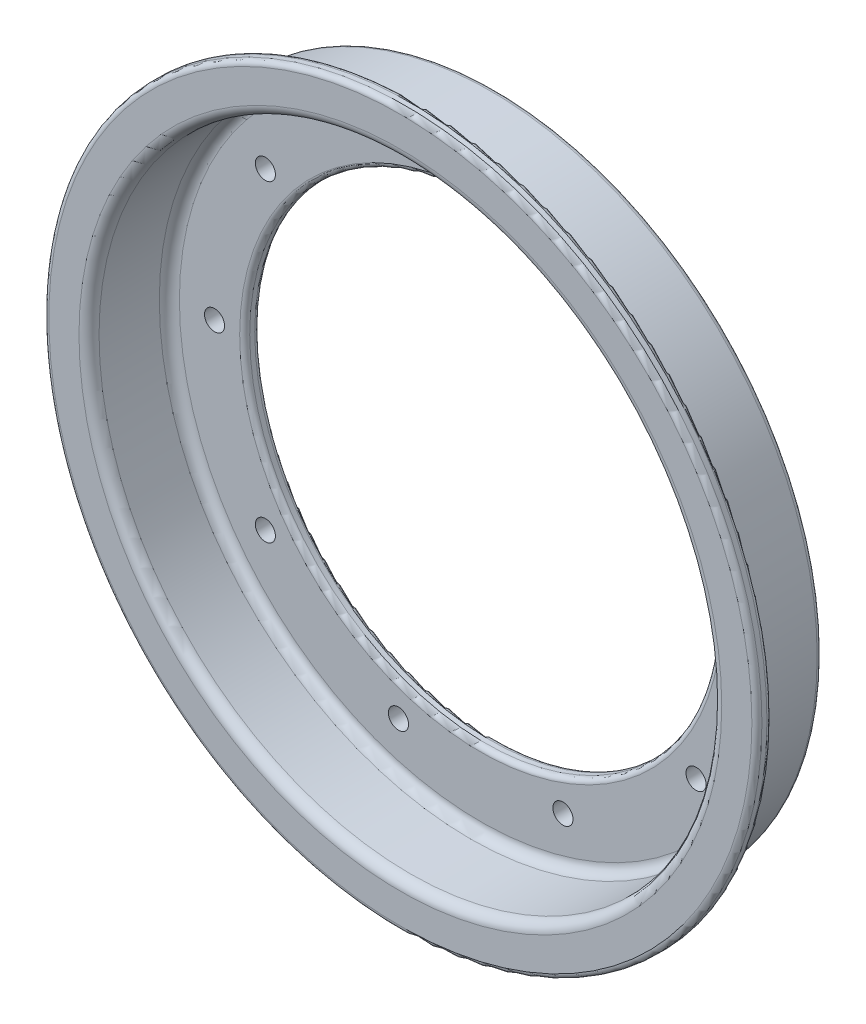
ISO-10303-21;
HEADER;
FILE_DESCRIPTION(('STEP AP214'),'2;1');
FILE_NAME('part.step','',(''),(''),'','','');
FILE_SCHEMA(('AUTOMOTIVE_DESIGN { 1 0 10303 214 1 1 1 1 }'));
ENDSEC;
DATA;
#1=APPLICATION_CONTEXT('core data for automotive mechanical design processes');
#2=APPLICATION_PROTOCOL_DEFINITION('international standard','automotive_design',2000,#1);
#3=PRODUCT_CONTEXT('',#1,'mechanical');
#4=PRODUCT('Part','Part','',(#3));
#5=PRODUCT_RELATED_PRODUCT_CATEGORY('part','',(#4));
#6=PRODUCT_DEFINITION_FORMATION('','',#4);
#7=PRODUCT_DEFINITION_CONTEXT('part definition',#1,'design');
#8=PRODUCT_DEFINITION('design','',#6,#7);
#9=PRODUCT_DEFINITION_SHAPE('','',#8);
#10=(LENGTH_UNIT() NAMED_UNIT(*) SI_UNIT(.MILLI.,.METRE.));
#11=(NAMED_UNIT(*) PLANE_ANGLE_UNIT() SI_UNIT($,.RADIAN.));
#12=(NAMED_UNIT(*) SI_UNIT($,.STERADIAN.) SOLID_ANGLE_UNIT());
#13=UNCERTAINTY_MEASURE_WITH_UNIT(LENGTH_MEASURE(1.E-05),#10,'distance_accuracy_value','');
#14=(GEOMETRIC_REPRESENTATION_CONTEXT(3) GLOBAL_UNCERTAINTY_ASSIGNED_CONTEXT((#13)) GLOBAL_UNIT_ASSIGNED_CONTEXT((#10,
#11,#12)) REPRESENTATION_CONTEXT('',''));
#15=CARTESIAN_POINT('',(0.,0.,0.));
#16=DIRECTION('',(0.,0.,1.));
#17=DIRECTION('',(1.,0.,0.));
#18=AXIS2_PLACEMENT_3D('',#15,#16,#17);
#19=CARTESIAN_POINT('',(0.,0.,3.));
#20=DIRECTION('',(0.,0.,-1.));
#21=DIRECTION('',(-1.,0.,0.));
#22=AXIS2_PLACEMENT_3D('',#19,#20,#21);
#23=CYLINDRICAL_SURFACE('',#22,62.);
#24=CARTESIAN_POINT('',(0.,0.,1.));
#25=DIRECTION('',(0.,0.,1.));
#26=DIRECTION('',(1.,0.,0.));
#27=AXIS2_PLACEMENT_3D('',#24,#25,#26);
#28=CIRCLE('',#27,62.);
#29=CARTESIAN_POINT('',(62.,0.,1.));
#30=VERTEX_POINT('',#29);
#31=EDGE_CURVE('E108',#30,#30,#28,.T.);
#32=ORIENTED_EDGE('',*,*,#31,.T.);
#33=EDGE_LOOP('',(#32));
#34=FACE_BOUND('',#33,.T.);
#35=CARTESIAN_POINT('',(0.,0.,-10.9999999997726));
#36=DIRECTION('',(0.,0.,-1.));
#37=DIRECTION('',(-1.,0.,0.));
#38=AXIS2_PLACEMENT_3D('',#35,#36,#37);
#39=CIRCLE('',#38,62.);
#40=CARTESIAN_POINT('',(-62.,0.,-10.9999999997738));
#41=VERTEX_POINT('',#40);
#42=EDGE_CURVE('E84',#41,#41,#39,.T.);
#43=ORIENTED_EDGE('',*,*,#42,.T.);
#44=EDGE_LOOP('',(#43));
#45=FACE_BOUND('',#44,.T.);
#46=ADVANCED_FACE('F34',(#34,#45),#23,.F.);
#47=CARTESIAN_POINT('',(0.,0.,3.));
#48=DIRECTION('',(0.,0.,1.));
#49=DIRECTION('',(1.,0.,0.));
#50=AXIS2_PLACEMENT_3D('',#47,#48,#49);
#51=PLANE('',#50);
#52=CARTESIAN_POINT('',(0.,0.,3.));
#53=DIRECTION('',(0.,0.,1.));
#54=DIRECTION('',(1.,0.,0.));
#55=AXIS2_PLACEMENT_3D('',#52,#53,#54);
#56=CIRCLE('',#55,70.);
#57=CARTESIAN_POINT('',(70.,0.,3.));
#58=VERTEX_POINT('',#57);
#59=EDGE_CURVE('E47',#58,#58,#56,.T.);
#60=ORIENTED_EDGE('',*,*,#59,.T.);
#61=EDGE_LOOP('',(#60));
#62=FACE_BOUND('',#61,.T.);
#63=CARTESIAN_POINT('',(0.,0.,3.));
#64=DIRECTION('',(0.,0.,1.));
#65=DIRECTION('',(1.,0.,0.));
#66=AXIS2_PLACEMENT_3D('',#63,#64,#65);
#67=CIRCLE('',#66,64.);
#68=CARTESIAN_POINT('',(64.,0.,3.));
#69=VERTEX_POINT('',#68);
#70=EDGE_CURVE('E111',#69,#69,#67,.F.);
#71=ORIENTED_EDGE('',*,*,#70,.T.);
#72=EDGE_LOOP('',(#71));
#73=FACE_BOUND('',#72,.T.);
#74=ADVANCED_FACE('F125',(#62,#73),#51,.T.);
#75=CARTESIAN_POINT('',(0.,0.,0.));
#76=DIRECTION('',(0.,0.,1.));
#77=DIRECTION('',(1.,0.,0.));
#78=AXIS2_PLACEMENT_3D('',#75,#76,#77);
#79=PLANE('',#78);
#80=CARTESIAN_POINT('',(0.,0.,0.));
#81=DIRECTION('',(0.,0.,1.));
#82=DIRECTION('',(1.,0.,0.));
#83=AXIS2_PLACEMENT_3D('',#80,#81,#82);
#84=CIRCLE('',#83,70.);
#85=CARTESIAN_POINT('',(70.,0.,0.));
#86=VERTEX_POINT('',#85);
#87=EDGE_CURVE('E120',#86,#86,#84,.F.);
#88=ORIENTED_EDGE('',*,*,#87,.T.);
#89=EDGE_LOOP('',(#88));
#90=FACE_BOUND('',#89,.T.);
#91=CARTESIAN_POINT('',(0.,0.,0.));
#92=DIRECTION('',(0.,0.,1.));
#93=DIRECTION('',(1.,0.,0.));
#94=AXIS2_PLACEMENT_3D('',#91,#92,#93);
#95=CIRCLE('',#94,65.);
#96=CARTESIAN_POINT('',(65.,0.,0.));
#97=VERTEX_POINT('',#96);
#98=EDGE_CURVE('E80',#97,#97,#95,.F.);
#99=ORIENTED_EDGE('',*,*,#98,.F.);
#100=EDGE_LOOP('',(#99));
#101=FACE_BOUND('',#100,.T.);
#102=ADVANCED_FACE('F148',(#90,#101),#79,.F.);
#103=CARTESIAN_POINT('',(0.,0.,3.));
#104=DIRECTION('',(0.,0.,-1.));
#105=DIRECTION('',(-1.,0.,0.));
#106=AXIS2_PLACEMENT_3D('',#103,#104,#105);
#107=CYLINDRICAL_SURFACE('',#106,71.);
#108=CARTESIAN_POINT('',(0.,0.,1.));
#109=DIRECTION('',(0.,0.,1.));
#110=DIRECTION('',(1.,0.,0.));
#111=AXIS2_PLACEMENT_3D('',#108,#109,#110);
#112=CIRCLE('',#111,71.);
#113=CARTESIAN_POINT('',(71.,0.,1.));
#114=VERTEX_POINT('',#113);
#115=EDGE_CURVE('E117',#114,#114,#112,.T.);
#116=ORIENTED_EDGE('',*,*,#115,.T.);
#117=EDGE_LOOP('',(#116));
#118=FACE_BOUND('',#117,.T.);
#119=CARTESIAN_POINT('',(0.,0.,2.));
#120=DIRECTION('',(0.,0.,1.));
#121=DIRECTION('',(1.,0.,0.));
#122=AXIS2_PLACEMENT_3D('',#119,#120,#121);
#123=CIRCLE('',#122,71.);
#124=CARTESIAN_POINT('',(71.,0.,2.));
#125=VERTEX_POINT('',#124);
#126=EDGE_CURVE('E114',#125,#125,#123,.F.);
#127=ORIENTED_EDGE('',*,*,#126,.T.);
#128=EDGE_LOOP('',(#127));
#129=FACE_BOUND('',#128,.T.);
#130=ADVANCED_FACE('F157',(#118,#129),#107,.T.);
#131=CARTESIAN_POINT('',(0.,0.,-202.847763108275));
#132=DIRECTION('',(0.,0.,1.));
#133=DIRECTION('',(1.,0.,0.));
#134=AXIS2_PLACEMENT_3D('',#131,#132,#133);
#135=CYLINDRICAL_SURFACE('',#134,65.);
#136=CARTESIAN_POINT('',(0.,0.,-14.9999999997727));
#137=DIRECTION('',(0.,0.,-1.));
#138=DIRECTION('',(-1.,0.,0.));
#139=AXIS2_PLACEMENT_3D('',#136,#137,#138);
#140=CIRCLE('',#139,65.);
#141=CARTESIAN_POINT('',(-65.,0.,-14.9999999997739));
#142=VERTEX_POINT('',#141);
#143=EDGE_CURVE('E10',#142,#142,#140,.F.);
#144=ORIENTED_EDGE('',*,*,#143,.T.);
#145=EDGE_LOOP('',(#144));
#146=FACE_BOUND('',#145,.T.);
#147=ORIENTED_EDGE('',*,*,#98,.T.);
#148=EDGE_LOOP('',(#147));
#149=FACE_BOUND('',#148,.T.);
#150=ADVANCED_FACE('F161',(#146,#149),#135,.T.);
#151=CARTESIAN_POINT('',(-29.500000000009,1.50600612186824E-11,-15.9999999997732));
#152=DIRECTION('',(0.,0.,-1.));
#153=DIRECTION('',(0.,-1.00000000000026,0.));
#154=AXIS2_PLACEMENT_3D('',#151,#152,#153);
#155=PLANE('',#154);
#156=CARTESIAN_POINT('',(-16.3779007018948,50.4059953636546,-15.9999999997738));
#157=DIRECTION('',(0.,0.,1.));
#158=DIRECTION('',(1.,0.,0.));
#159=AXIS2_PLACEMENT_3D('',#156,#157,#158);
#160=CIRCLE('',#159,2.00000000000331);
#161=CARTESIAN_POINT('',(-14.3779007018915,50.4059953636546,-15.9999999997738));
#162=VERTEX_POINT('',#161);
#163=EDGE_CURVE('E385',#162,#162,#160,.T.);
#164=ORIENTED_EDGE('',*,*,#163,.T.);
#165=EDGE_LOOP('',(#164));
#166=FACE_BOUND('',#165,.T.);
#167=CARTESIAN_POINT('',(-42.877900701898,31.1526183714959,-15.9999999997738));
#168=DIRECTION('',(0.,0.,1.));
#169=DIRECTION('',(1.,0.,0.));
#170=AXIS2_PLACEMENT_3D('',#167,#168,#169);
#171=CIRCLE('',#170,2.00000000000374);
#172=CARTESIAN_POINT('',(-40.8779007018943,31.1526183714959,-15.9999999997738));
#173=VERTEX_POINT('',#172);
#174=EDGE_CURVE('E386',#173,#173,#171,.T.);
#175=ORIENTED_EDGE('',*,*,#174,.T.);
#176=EDGE_LOOP('',(#175));
#177=FACE_BOUND('',#176,.T.);
#178=CARTESIAN_POINT('',(-53.0000000000187,-2.04580804089934E-11,-15.9999999997738));
#179=DIRECTION('',(0.,0.,1.));
#180=DIRECTION('',(1.,0.,0.));
#181=AXIS2_PLACEMENT_3D('',#178,#179,#180);
#182=CIRCLE('',#181,2.00000000000327);
#183=CARTESIAN_POINT('',(-51.0000000000154,-2.04580804089934E-11,-15.9999999997738));
#184=VERTEX_POINT('',#183);
#185=EDGE_CURVE('E390',#184,#184,#182,.T.);
#186=ORIENTED_EDGE('',*,*,#185,.T.);
#187=EDGE_LOOP('',(#186));
#188=FACE_BOUND('',#187,.T.);
#189=CARTESIAN_POINT('',(-42.8779007018761,-31.1526183715297,-15.9999999997738));
#190=DIRECTION('',(0.,0.,1.));
#191=DIRECTION('',(1.,0.,0.));
#192=AXIS2_PLACEMENT_3D('',#189,#190,#191);
#193=CIRCLE('',#192,2.00000000000213);
#194=CARTESIAN_POINT('',(-40.877900701874,-31.1526183715297,-15.9999999997738));
#195=VERTEX_POINT('',#194);
#196=EDGE_CURVE('E406',#195,#195,#193,.T.);
#197=ORIENTED_EDGE('',*,*,#196,.T.);
#198=EDGE_LOOP('',(#197));
#199=FACE_BOUND('',#198,.T.);
#200=CARTESIAN_POINT('',(-16.3779007018594,-50.4059953636697,-15.9999999997738));
#201=DIRECTION('',(0.,0.,1.));
#202=DIRECTION('',(1.,0.,0.));
#203=AXIS2_PLACEMENT_3D('',#200,#201,#202);
#204=CIRCLE('',#203,2.00000000000071);
#205=CARTESIAN_POINT('',(-14.3779007018587,-50.4059953636697,-15.9999999997738));
#206=VERTEX_POINT('',#205);
#207=EDGE_CURVE('E404',#206,#206,#204,.T.);
#208=ORIENTED_EDGE('',*,*,#207,.T.);
#209=EDGE_LOOP('',(#208));
#210=FACE_BOUND('',#209,.T.);
#211=CARTESIAN_POINT('',(16.3779007018974,-50.4059953636582,-15.9999999997738));
#212=DIRECTION('',(0.,0.,1.));
#213=DIRECTION('',(1.,0.,0.));
#214=AXIS2_PLACEMENT_3D('',#211,#212,#213);
#215=CIRCLE('',#214,1.99999999999956);
#216=CARTESIAN_POINT('',(18.377900701897,-50.4059953636582,-15.9999999997738));
#217=VERTEX_POINT('',#216);
#218=EDGE_CURVE('E402',#217,#217,#215,.T.);
#219=ORIENTED_EDGE('',*,*,#218,.T.);
#220=EDGE_LOOP('',(#219));
#221=FACE_BOUND('',#220,.T.);
#222=CARTESIAN_POINT('',(42.8779007019006,-31.1526183714996,-15.9999999997738));
#223=DIRECTION('',(0.,0.,1.));
#224=DIRECTION('',(1.,0.,0.));
#225=AXIS2_PLACEMENT_3D('',#222,#223,#224);
#226=CIRCLE('',#225,1.99999999999909);
#227=CARTESIAN_POINT('',(44.8779007018997,-31.1526183714996,-15.9999999997738));
#228=VERTEX_POINT('',#227);
#229=EDGE_CURVE('E399',#228,#228,#226,.T.);
#230=ORIENTED_EDGE('',*,*,#229,.T.);
#231=EDGE_LOOP('',(#230));
#232=FACE_BOUND('',#231,.T.);
#233=CARTESIAN_POINT('',(53.0000000000213,1.67808767298783E-11,-15.9999999997738));
#234=DIRECTION('',(0.,0.,1.));
#235=DIRECTION('',(1.,0.,0.));
#236=AXIS2_PLACEMENT_3D('',#233,#234,#235);
#237=CIRCLE('',#236,1.99999999999947);
#238=CARTESIAN_POINT('',(55.0000000000208,1.67808767298783E-11,-15.9999999997738));
#239=VERTEX_POINT('',#238);
#240=EDGE_CURVE('E396',#239,#239,#237,.T.);
#241=ORIENTED_EDGE('',*,*,#240,.T.);
#242=EDGE_LOOP('',(#241));
#243=FACE_BOUND('',#242,.T.);
#244=CARTESIAN_POINT('',(16.377900701862,50.4059953636661,-15.9999999997738));
#245=DIRECTION('',(0.,0.,1.));
#246=DIRECTION('',(1.,0.,0.));
#247=AXIS2_PLACEMENT_3D('',#244,#245,#246);
#248=CIRCLE('',#247,2.00000000000219);
#249=CARTESIAN_POINT('',(18.3779007018642,50.4059953636661,-15.9999999997738));
#250=VERTEX_POINT('',#249);
#251=EDGE_CURVE('E387',#250,#250,#248,.T.);
#252=ORIENTED_EDGE('',*,*,#251,.T.);
#253=EDGE_LOOP('',(#252));
#254=FACE_BOUND('',#253,.T.);
#255=CARTESIAN_POINT('',(42.8779007018787,31.152618371526,-15.9999999997738));
#256=DIRECTION('',(0.,0.,1.));
#257=DIRECTION('',(1.,0.,0.));
#258=AXIS2_PLACEMENT_3D('',#255,#256,#257);
#259=CIRCLE('',#258,2.00000000000058);
#260=CARTESIAN_POINT('',(44.8779007018793,31.152618371526,-15.9999999997738));
#261=VERTEX_POINT('',#260);
#262=EDGE_CURVE('E55',#261,#261,#259,.T.);
#263=ORIENTED_EDGE('',*,*,#262,.T.);
#264=EDGE_LOOP('',(#263));
#265=FACE_BOUND('',#264,.T.);
#266=CARTESIAN_POINT('',(0.,0.,-15.9999999997727));
#267=DIRECTION('',(0.,0.,-1.));
#268=DIRECTION('',(-1.,0.,0.));
#269=AXIS2_PLACEMENT_3D('',#266,#267,#268);
#270=CIRCLE('',#269,64.);
#271=CARTESIAN_POINT('',(-64.,0.,-15.9999999997738));
#272=VERTEX_POINT('',#271);
#273=EDGE_CURVE('E42',#272,#272,#270,.T.);
#274=ORIENTED_EDGE('',*,*,#273,.T.);
#275=EDGE_LOOP('',(#274));
#276=FACE_BOUND('',#275,.T.);
#277=CARTESIAN_POINT('',(2.02129438407652E-12,6.671576830151E-13,-15.9999999997727));
#278=DIRECTION('',(0.,0.,-1.));
#279=DIRECTION('',(-1.,0.,0.));
#280=AXIS2_PLACEMENT_3D('',#277,#278,#279);
#281=CIRCLE('',#280,48.0000000000123);
#282=CARTESIAN_POINT('',(-48.0000000000103,6.671576830151E-13,-15.9999999997735));
#283=VERTEX_POINT('',#282);
#284=EDGE_CURVE('E105',#283,#283,#281,.F.);
#285=ORIENTED_EDGE('',*,*,#284,.T.);
#286=EDGE_LOOP('',(#285));
#287=FACE_BOUND('',#286,.T.);
#288=ADVANCED_FACE('F152',(#166,#177,#188,#199,#210,#221,#232,#243,#254,#265,#276,#287),#155,.T.);
#289=CARTESIAN_POINT('',(0.,0.,-12.9999999997727));
#290=DIRECTION('',(0.,0.,-1.));
#291=DIRECTION('',(-1.,0.,0.));
#292=AXIS2_PLACEMENT_3D('',#289,#290,#291);
#293=PLANE('',#292);
#294=CARTESIAN_POINT('',(-16.3779007018948,50.4059953636546,-12.9999999997725));
#295=DIRECTION('',(0.,0.,-1.));
#296=DIRECTION('',(-1.,0.,0.));
#297=AXIS2_PLACEMENT_3D('',#294,#295,#296);
#298=CIRCLE('',#297,2.00000000000331);
#299=CARTESIAN_POINT('',(-18.3779007018981,50.4059953636546,-12.9999999997725));
#300=VERTEX_POINT('',#299);
#301=EDGE_CURVE('E38',#300,#300,#298,.T.);
#302=ORIENTED_EDGE('',*,*,#301,.T.);
#303=EDGE_LOOP('',(#302));
#304=FACE_BOUND('',#303,.T.);
#305=CARTESIAN_POINT('',(-42.877900701898,31.1526183714959,-12.9999999997731));
#306=DIRECTION('',(0.,0.,-1.));
#307=DIRECTION('',(-1.,0.,0.));
#308=AXIS2_PLACEMENT_3D('',#305,#306,#307);
#309=CIRCLE('',#308,2.00000000000374);
#310=CARTESIAN_POINT('',(-44.8779007019018,31.1526183714959,-12.9999999997732));
#311=VERTEX_POINT('',#310);
#312=EDGE_CURVE('E75',#311,#311,#309,.T.);
#313=ORIENTED_EDGE('',*,*,#312,.T.);
#314=EDGE_LOOP('',(#313));
#315=FACE_BOUND('',#314,.T.);
#316=CARTESIAN_POINT('',(-53.0000000000187,-2.04580804089934E-11,-12.9999999997736));
#317=DIRECTION('',(0.,0.,-1.));
#318=DIRECTION('',(-1.,0.,0.));
#319=AXIS2_PLACEMENT_3D('',#316,#317,#318);
#320=CIRCLE('',#319,2.00000000000327);
#321=CARTESIAN_POINT('',(-55.0000000000219,-2.04580804089934E-11,-12.9999999997737));
#322=VERTEX_POINT('',#321);
#323=EDGE_CURVE('E73',#322,#322,#320,.T.);
#324=ORIENTED_EDGE('',*,*,#323,.T.);
#325=EDGE_LOOP('',(#324));
#326=FACE_BOUND('',#325,.T.);
#327=CARTESIAN_POINT('',(-42.8779007018761,-31.1526183715297,-12.9999999997738));
#328=DIRECTION('',(0.,0.,-1.));
#329=DIRECTION('',(-1.,0.,0.));
#330=AXIS2_PLACEMENT_3D('',#327,#328,#329);
#331=CIRCLE('',#330,2.00000000000213);
#332=CARTESIAN_POINT('',(-44.8779007018782,-31.1526183715297,-12.9999999997738));
#333=VERTEX_POINT('',#332);
#334=EDGE_CURVE('E70',#333,#333,#331,.T.);
#335=ORIENTED_EDGE('',*,*,#334,.T.);
#336=EDGE_LOOP('',(#335));
#337=FACE_BOUND('',#336,.T.);
#338=CARTESIAN_POINT('',(-16.3779007018594,-50.4059953636697,-12.9999999997735));
#339=DIRECTION('',(0.,0.,-1.));
#340=DIRECTION('',(-1.,0.,0.));
#341=AXIS2_PLACEMENT_3D('',#338,#339,#340);
#342=CIRCLE('',#341,2.00000000000071);
#343=CARTESIAN_POINT('',(-18.3779007018601,-50.4059953636697,-12.9999999997735));
#344=VERTEX_POINT('',#343);
#345=EDGE_CURVE('E67',#344,#344,#342,.T.);
#346=ORIENTED_EDGE('',*,*,#345,.T.);
#347=EDGE_LOOP('',(#346));
#348=FACE_BOUND('',#347,.T.);
#349=CARTESIAN_POINT('',(16.3779007018974,-50.4059953636582,-12.9999999997729));
#350=DIRECTION('',(0.,0.,-1.));
#351=DIRECTION('',(-1.,0.,0.));
#352=AXIS2_PLACEMENT_3D('',#349,#350,#351);
#353=CIRCLE('',#352,1.99999999999956);
#354=CARTESIAN_POINT('',(14.3779007018978,-50.4059953636582,-12.9999999997729));
#355=VERTEX_POINT('',#354);
#356=EDGE_CURVE('E64',#355,#355,#353,.T.);
#357=ORIENTED_EDGE('',*,*,#356,.T.);
#358=EDGE_LOOP('',(#357));
#359=FACE_BOUND('',#358,.T.);
#360=CARTESIAN_POINT('',(42.8779007019006,-31.1526183714996,-12.9999999997722));
#361=DIRECTION('',(0.,0.,-1.));
#362=DIRECTION('',(-1.,0.,0.));
#363=AXIS2_PLACEMENT_3D('',#360,#361,#362);
#364=CIRCLE('',#363,1.99999999999909);
#365=CARTESIAN_POINT('',(40.8779007019015,-31.1526183714996,-12.9999999997723));
#366=VERTEX_POINT('',#365);
#367=EDGE_CURVE('E61',#366,#366,#364,.T.);
#368=ORIENTED_EDGE('',*,*,#367,.T.);
#369=EDGE_LOOP('',(#368));
#370=FACE_BOUND('',#369,.T.);
#371=CARTESIAN_POINT('',(53.0000000000213,1.67808767298783E-11,-12.9999999997717));
#372=DIRECTION('',(0.,0.,-1.));
#373=DIRECTION('',(-1.,0.,0.));
#374=AXIS2_PLACEMENT_3D('',#371,#372,#373);
#375=CIRCLE('',#374,1.99999999999947);
#376=CARTESIAN_POINT('',(51.0000000000218,1.67808767298783E-11,-12.9999999997718));
#377=VERTEX_POINT('',#376);
#378=EDGE_CURVE('E58',#377,#377,#375,.T.);
#379=ORIENTED_EDGE('',*,*,#378,.T.);
#380=EDGE_LOOP('',(#379));
#381=FACE_BOUND('',#380,.T.);
#382=CARTESIAN_POINT('',(16.377900701862,50.4059953636661,-12.9999999997719));
#383=DIRECTION('',(0.,0.,-1.));
#384=DIRECTION('',(-1.,0.,0.));
#385=AXIS2_PLACEMENT_3D('',#382,#383,#384);
#386=CIRCLE('',#385,2.00000000000219);
#387=CARTESIAN_POINT('',(14.3779007018598,50.4059953636661,-12.9999999997719));
#388=VERTEX_POINT('',#387);
#389=EDGE_CURVE('E54',#388,#388,#386,.T.);
#390=ORIENTED_EDGE('',*,*,#389,.T.);
#391=EDGE_LOOP('',(#390));
#392=FACE_BOUND('',#391,.T.);
#393=CARTESIAN_POINT('',(42.8779007018787,31.152618371526,-12.9999999997716));
#394=DIRECTION('',(0.,0.,-1.));
#395=DIRECTION('',(-1.,0.,0.));
#396=AXIS2_PLACEMENT_3D('',#393,#394,#395);
#397=CIRCLE('',#396,2.00000000000058);
#398=CARTESIAN_POINT('',(40.8779007018782,31.152618371526,-12.9999999997716));
#399=VERTEX_POINT('',#398);
#400=EDGE_CURVE('E51',#399,#399,#397,.T.);
#401=ORIENTED_EDGE('',*,*,#400,.T.);
#402=EDGE_LOOP('',(#401));
#403=FACE_BOUND('',#402,.T.);
#404=CARTESIAN_POINT('',(1.96736356280976E-12,6.3608647176148E-13,-12.9999999997727));
#405=DIRECTION('',(0.,0.,-1.));
#406=DIRECTION('',(-1.,0.,0.));
#407=AXIS2_PLACEMENT_3D('',#404,#405,#406);
#408=CIRCLE('',#407,48.0000000000123);
#409=CARTESIAN_POINT('',(-48.0000000000103,6.3608647176148E-13,-12.9999999997735));
#410=VERTEX_POINT('',#409);
#411=EDGE_CURVE('E96',#410,#410,#408,.T.);
#412=ORIENTED_EDGE('',*,*,#411,.T.);
#413=EDGE_LOOP('',(#412));
#414=FACE_BOUND('',#413,.T.);
#415=CARTESIAN_POINT('',(0.,0.,-12.9999999997727));
#416=DIRECTION('',(0.,0.,-1.));
#417=DIRECTION('',(-1.,0.,0.));
#418=AXIS2_PLACEMENT_3D('',#415,#416,#417);
#419=CIRCLE('',#418,60.);
#420=CARTESIAN_POINT('',(-60.,0.,-12.9999999997738));
#421=VERTEX_POINT('',#420);
#422=EDGE_CURVE('E89',#421,#421,#419,.F.);
#423=ORIENTED_EDGE('',*,*,#422,.T.);
#424=EDGE_LOOP('',(#423));
#425=FACE_BOUND('',#424,.T.);
#426=ADVANCED_FACE('F223',(#304,#315,#326,#337,#348,#359,#370,#381,#392,#403,#414,#425),#293,.F.);
#427=CARTESIAN_POINT('',(2.02129438407652E-12,6.671576830151E-13,-15.9999999997727));
#428=DIRECTION('',(0.,0.,1.));
#429=DIRECTION('',(1.,0.,0.));
#430=AXIS2_PLACEMENT_3D('',#427,#428,#429);
#431=CYLINDRICAL_SURFACE('',#430,47.0000000000123);
#432=CARTESIAN_POINT('',(1.98534050323201E-12,6.46443542179353E-13,-13.9999999997727));
#433=DIRECTION('',(0.,0.,-1.));
#434=DIRECTION('',(-1.,0.,0.));
#435=AXIS2_PLACEMENT_3D('',#432,#433,#434);
#436=CIRCLE('',#435,47.0000000000123);
#437=CARTESIAN_POINT('',(-47.0000000000103,6.46443542179353E-13,-13.9999999997735));
#438=VERTEX_POINT('',#437);
#439=EDGE_CURVE('E102',#438,#438,#436,.F.);
#440=ORIENTED_EDGE('',*,*,#439,.T.);
#441=EDGE_LOOP('',(#440));
#442=FACE_BOUND('',#441,.T.);
#443=CARTESIAN_POINT('',(2.00331744365427E-12,6.56800612597227E-13,-14.9999999997727));
#444=DIRECTION('',(0.,0.,-1.));
#445=DIRECTION('',(-1.,0.,0.));
#446=AXIS2_PLACEMENT_3D('',#443,#444,#445);
#447=CIRCLE('',#446,47.0000000000123);
#448=CARTESIAN_POINT('',(-47.0000000000103,6.56800612597227E-13,-14.9999999997735));
#449=VERTEX_POINT('',#448);
#450=EDGE_CURVE('E99',#449,#449,#447,.T.);
#451=ORIENTED_EDGE('',*,*,#450,.T.);
#452=EDGE_LOOP('',(#451));
#453=FACE_BOUND('',#452,.T.);
#454=ADVANCED_FACE('F167',(#442,#453),#431,.F.);
#455=CARTESIAN_POINT('',(0.,0.,-10.9999999997727));
#456=DIRECTION('',(0.,0.,-1.));
#457=DIRECTION('',(-1.,0.,0.));
#458=AXIS2_PLACEMENT_3D('',#455,#456,#457);
#459=TOROIDAL_SURFACE('',#458,60.,2.);
#460=ORIENTED_EDGE('',*,*,#422,.F.);
#461=EDGE_LOOP('',(#460));
#462=FACE_BOUND('',#461,.T.);
#463=ORIENTED_EDGE('',*,*,#42,.F.);
#464=EDGE_LOOP('',(#463));
#465=FACE_BOUND('',#464,.T.);
#466=ADVANCED_FACE('F163',(#462,#465),#459,.F.);
#467=CARTESIAN_POINT('',(1.98534050323201E-12,6.46443542179353E-13,-13.9999999997727));
#468=DIRECTION('',(0.,0.,-1.));
#469=DIRECTION('',(-1.,0.,0.));
#470=AXIS2_PLACEMENT_3D('',#467,#468,#469);
#471=TOROIDAL_SURFACE('',#470,48.0000000000123,1.);
#472=ORIENTED_EDGE('',*,*,#439,.F.);
#473=EDGE_LOOP('',(#472));
#474=FACE_BOUND('',#473,.T.);
#475=ORIENTED_EDGE('',*,*,#411,.F.);
#476=EDGE_LOOP('',(#475));
#477=FACE_BOUND('',#476,.T.);
#478=ADVANCED_FACE('F166',(#474,#477),#471,.T.);
#479=CARTESIAN_POINT('',(2.00331744365427E-12,6.56800612597227E-13,-14.9999999997727));
#480=DIRECTION('',(0.,0.,-1.));
#481=DIRECTION('',(-1.,0.,0.));
#482=AXIS2_PLACEMENT_3D('',#479,#480,#481);
#483=TOROIDAL_SURFACE('',#482,48.0000000000123,1.);
#484=ORIENTED_EDGE('',*,*,#284,.F.);
#485=EDGE_LOOP('',(#484));
#486=FACE_BOUND('',#485,.T.);
#487=ORIENTED_EDGE('',*,*,#450,.F.);
#488=EDGE_LOOP('',(#487));
#489=FACE_BOUND('',#488,.T.);
#490=ADVANCED_FACE('F171',(#486,#489),#483,.T.);
#491=CARTESIAN_POINT('',(0.,0.,1.));
#492=DIRECTION('',(0.,0.,1.));
#493=DIRECTION('',(1.,0.,0.));
#494=AXIS2_PLACEMENT_3D('',#491,#492,#493);
#495=TOROIDAL_SURFACE('',#494,64.,2.);
#496=ORIENTED_EDGE('',*,*,#70,.F.);
#497=EDGE_LOOP('',(#496));
#498=FACE_BOUND('',#497,.T.);
#499=ORIENTED_EDGE('',*,*,#31,.F.);
#500=EDGE_LOOP('',(#499));
#501=FACE_BOUND('',#500,.T.);
#502=ADVANCED_FACE('F138',(#498,#501),#495,.T.);
#503=CARTESIAN_POINT('',(0.,0.,1.));
#504=DIRECTION('',(0.,0.,1.));
#505=DIRECTION('',(1.,0.,0.));
#506=AXIS2_PLACEMENT_3D('',#503,#504,#505);
#507=TOROIDAL_SURFACE('',#506,70.,1.);
#508=ORIENTED_EDGE('',*,*,#87,.F.);
#509=EDGE_LOOP('',(#508));
#510=FACE_BOUND('',#509,.T.);
#511=ORIENTED_EDGE('',*,*,#115,.F.);
#512=EDGE_LOOP('',(#511));
#513=FACE_BOUND('',#512,.T.);
#514=ADVANCED_FACE('F130',(#510,#513),#507,.T.);
#515=CARTESIAN_POINT('',(0.,0.,2.));
#516=DIRECTION('',(0.,0.,1.));
#517=DIRECTION('',(1.,0.,0.));
#518=AXIS2_PLACEMENT_3D('',#515,#516,#517);
#519=TOROIDAL_SURFACE('',#518,70.,1.);
#520=ORIENTED_EDGE('',*,*,#126,.F.);
#521=EDGE_LOOP('',(#520));
#522=FACE_BOUND('',#521,.T.);
#523=ORIENTED_EDGE('',*,*,#59,.F.);
#524=EDGE_LOOP('',(#523));
#525=FACE_BOUND('',#524,.T.);
#526=ADVANCED_FACE('F128',(#522,#525),#519,.T.);
#527=CARTESIAN_POINT('',(0.,0.,-14.9999999997727));
#528=DIRECTION('',(0.,0.,-1.));
#529=DIRECTION('',(-1.,0.,0.));
#530=AXIS2_PLACEMENT_3D('',#527,#528,#529);
#531=TOROIDAL_SURFACE('',#530,64.,1.);
#532=ORIENTED_EDGE('',*,*,#143,.F.);
#533=EDGE_LOOP('',(#532));
#534=FACE_BOUND('',#533,.T.);
#535=ORIENTED_EDGE('',*,*,#273,.F.);
#536=EDGE_LOOP('',(#535));
#537=FACE_BOUND('',#536,.T.);
#538=ADVANCED_FACE('F36',(#534,#537),#531,.T.);
#539=CARTESIAN_POINT('',(42.8779007018787,31.152618371526,-15.9999999997738));
#540=DIRECTION('',(0.,0.,1.));
#541=DIRECTION('',(1.,0.,0.));
#542=AXIS2_PLACEMENT_3D('',#539,#540,#541);
#543=CYLINDRICAL_SURFACE('',#542,2.00000000000058);
#544=ORIENTED_EDGE('',*,*,#262,.F.);
#545=EDGE_LOOP('',(#544));
#546=FACE_BOUND('',#545,.T.);
#547=ORIENTED_EDGE('',*,*,#400,.F.);
#548=EDGE_LOOP('',(#547));
#549=FACE_BOUND('',#548,.T.);
#550=ADVANCED_FACE('F136',(#546,#549),#543,.F.);
#551=CARTESIAN_POINT('',(16.377900701862,50.4059953636661,-15.9999999997738));
#552=DIRECTION('',(0.,0.,1.));
#553=DIRECTION('',(1.,0.,0.));
#554=AXIS2_PLACEMENT_3D('',#551,#552,#553);
#555=CYLINDRICAL_SURFACE('',#554,2.00000000000219);
#556=ORIENTED_EDGE('',*,*,#251,.F.);
#557=EDGE_LOOP('',(#556));
#558=FACE_BOUND('',#557,.T.);
#559=ORIENTED_EDGE('',*,*,#389,.F.);
#560=EDGE_LOOP('',(#559));
#561=FACE_BOUND('',#560,.T.);
#562=ADVANCED_FACE('F241',(#558,#561),#555,.F.);
#563=CARTESIAN_POINT('',(53.0000000000213,1.67808767298783E-11,-15.9999999997738));
#564=DIRECTION('',(0.,0.,1.));
#565=DIRECTION('',(1.,0.,0.));
#566=AXIS2_PLACEMENT_3D('',#563,#564,#565);
#567=CYLINDRICAL_SURFACE('',#566,1.99999999999947);
#568=ORIENTED_EDGE('',*,*,#240,.F.);
#569=EDGE_LOOP('',(#568));
#570=FACE_BOUND('',#569,.T.);
#571=ORIENTED_EDGE('',*,*,#378,.F.);
#572=EDGE_LOOP('',(#571));
#573=FACE_BOUND('',#572,.T.);
#574=ADVANCED_FACE('F251',(#570,#573),#567,.F.);
#575=CARTESIAN_POINT('',(42.8779007019006,-31.1526183714996,-15.9999999997738));
#576=DIRECTION('',(0.,0.,1.));
#577=DIRECTION('',(1.,0.,0.));
#578=AXIS2_PLACEMENT_3D('',#575,#576,#577);
#579=CYLINDRICAL_SURFACE('',#578,1.99999999999909);
#580=ORIENTED_EDGE('',*,*,#229,.F.);
#581=EDGE_LOOP('',(#580));
#582=FACE_BOUND('',#581,.T.);
#583=ORIENTED_EDGE('',*,*,#367,.F.);
#584=EDGE_LOOP('',(#583));
#585=FACE_BOUND('',#584,.T.);
#586=ADVANCED_FACE('F261',(#582,#585),#579,.F.);
#587=CARTESIAN_POINT('',(16.3779007018974,-50.4059953636582,-15.9999999997738));
#588=DIRECTION('',(0.,0.,1.));
#589=DIRECTION('',(1.,0.,0.));
#590=AXIS2_PLACEMENT_3D('',#587,#588,#589);
#591=CYLINDRICAL_SURFACE('',#590,1.99999999999956);
#592=ORIENTED_EDGE('',*,*,#218,.F.);
#593=EDGE_LOOP('',(#592));
#594=FACE_BOUND('',#593,.T.);
#595=ORIENTED_EDGE('',*,*,#356,.F.);
#596=EDGE_LOOP('',(#595));
#597=FACE_BOUND('',#596,.T.);
#598=ADVANCED_FACE('F271',(#594,#597),#591,.F.);
#599=CARTESIAN_POINT('',(-16.3779007018594,-50.4059953636697,-15.9999999997738));
#600=DIRECTION('',(0.,0.,1.));
#601=DIRECTION('',(1.,0.,0.));
#602=AXIS2_PLACEMENT_3D('',#599,#600,#601);
#603=CYLINDRICAL_SURFACE('',#602,2.00000000000071);
#604=ORIENTED_EDGE('',*,*,#207,.F.);
#605=EDGE_LOOP('',(#604));
#606=FACE_BOUND('',#605,.T.);
#607=ORIENTED_EDGE('',*,*,#345,.F.);
#608=EDGE_LOOP('',(#607));
#609=FACE_BOUND('',#608,.T.);
#610=ADVANCED_FACE('F281',(#606,#609),#603,.F.);
#611=CARTESIAN_POINT('',(-42.8779007018761,-31.1526183715297,-15.9999999997738));
#612=DIRECTION('',(0.,0.,1.));
#613=DIRECTION('',(1.,0.,0.));
#614=AXIS2_PLACEMENT_3D('',#611,#612,#613);
#615=CYLINDRICAL_SURFACE('',#614,2.00000000000213);
#616=ORIENTED_EDGE('',*,*,#196,.F.);
#617=EDGE_LOOP('',(#616));
#618=FACE_BOUND('',#617,.T.);
#619=ORIENTED_EDGE('',*,*,#334,.F.);
#620=EDGE_LOOP('',(#619));
#621=FACE_BOUND('',#620,.T.);
#622=ADVANCED_FACE('F291',(#618,#621),#615,.F.);
#623=CARTESIAN_POINT('',(-53.0000000000187,-2.04580804089934E-11,-15.9999999997738));
#624=DIRECTION('',(0.,0.,1.));
#625=DIRECTION('',(1.,0.,0.));
#626=AXIS2_PLACEMENT_3D('',#623,#624,#625);
#627=CYLINDRICAL_SURFACE('',#626,2.00000000000327);
#628=ORIENTED_EDGE('',*,*,#185,.F.);
#629=EDGE_LOOP('',(#628));
#630=FACE_BOUND('',#629,.T.);
#631=ORIENTED_EDGE('',*,*,#323,.F.);
#632=EDGE_LOOP('',(#631));
#633=FACE_BOUND('',#632,.T.);
#634=ADVANCED_FACE('F301',(#630,#633),#627,.F.);
#635=CARTESIAN_POINT('',(-42.877900701898,31.1526183714959,-15.9999999997738));
#636=DIRECTION('',(0.,0.,1.));
#637=DIRECTION('',(1.,0.,0.));
#638=AXIS2_PLACEMENT_3D('',#635,#636,#637);
#639=CYLINDRICAL_SURFACE('',#638,2.00000000000374);
#640=ORIENTED_EDGE('',*,*,#174,.F.);
#641=EDGE_LOOP('',(#640));
#642=FACE_BOUND('',#641,.T.);
#643=ORIENTED_EDGE('',*,*,#312,.F.);
#644=EDGE_LOOP('',(#643));
#645=FACE_BOUND('',#644,.T.);
#646=ADVANCED_FACE('F311',(#642,#645),#639,.F.);
#647=CARTESIAN_POINT('',(-16.3779007018948,50.4059953636546,-15.9999999997738));
#648=DIRECTION('',(0.,0.,1.));
#649=DIRECTION('',(1.,0.,0.));
#650=AXIS2_PLACEMENT_3D('',#647,#648,#649);
#651=CYLINDRICAL_SURFACE('',#650,2.00000000000331);
#652=ORIENTED_EDGE('',*,*,#163,.F.);
#653=EDGE_LOOP('',(#652));
#654=FACE_BOUND('',#653,.T.);
#655=ORIENTED_EDGE('',*,*,#301,.F.);
#656=EDGE_LOOP('',(#655));
#657=FACE_BOUND('',#656,.T.);
#658=ADVANCED_FACE('F321',(#654,#657),#651,.F.);
#659=CLOSED_SHELL('',(#46,#74,#102,#130,#150,#288,#426,#454,#466,#478,#490,#502,#514,#526,#538,
#550,#562,#574,#586,#598,#610,#622,#634,#646,#658));
#660=MANIFOLD_SOLID_BREP('B2',#659);
#661=ADVANCED_BREP_SHAPE_REPRESENTATION('',(#18,#660),#14);
#662=SHAPE_DEFINITION_REPRESENTATION(#9,#661);
ENDSEC;
END-ISO-10303-21;
